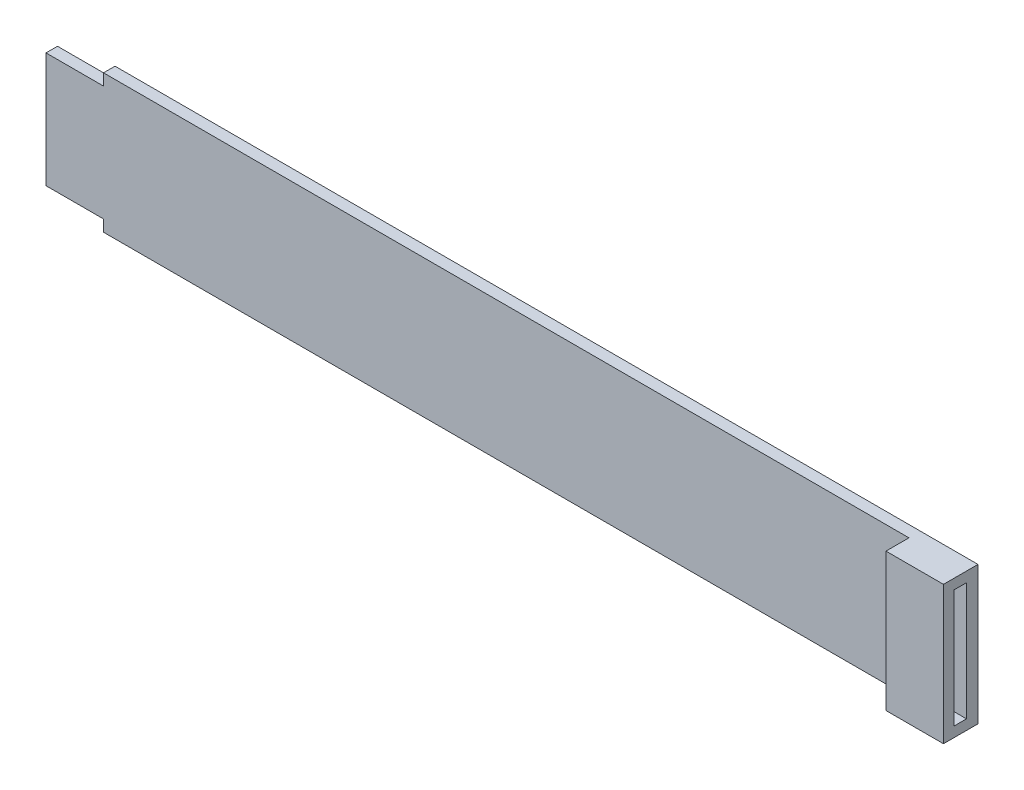
ISO-10303-21;
HEADER;
FILE_DESCRIPTION(('STEP AP214'),'2;1');
FILE_NAME('part.step','',(''),(''),'','','');
FILE_SCHEMA(('AUTOMOTIVE_DESIGN { 1 0 10303 214 1 1 1 1 }'));
ENDSEC;
DATA;
#1=APPLICATION_CONTEXT('core data for automotive mechanical design processes');
#2=APPLICATION_PROTOCOL_DEFINITION('international standard','automotive_design',2000,#1);
#3=PRODUCT_CONTEXT('',#1,'mechanical');
#4=PRODUCT('Part','Part','',(#3));
#5=PRODUCT_RELATED_PRODUCT_CATEGORY('part','',(#4));
#6=PRODUCT_DEFINITION_FORMATION('','',#4);
#7=PRODUCT_DEFINITION_CONTEXT('part definition',#1,'design');
#8=PRODUCT_DEFINITION('design','',#6,#7);
#9=PRODUCT_DEFINITION_SHAPE('','',#8);
#10=(LENGTH_UNIT() NAMED_UNIT(*) SI_UNIT(.MILLI.,.METRE.));
#11=(NAMED_UNIT(*) PLANE_ANGLE_UNIT() SI_UNIT($,.RADIAN.));
#12=(NAMED_UNIT(*) SI_UNIT($,.STERADIAN.) SOLID_ANGLE_UNIT());
#13=UNCERTAINTY_MEASURE_WITH_UNIT(LENGTH_MEASURE(1.E-05),#10,'distance_accuracy_value','');
#14=(GEOMETRIC_REPRESENTATION_CONTEXT(3) GLOBAL_UNCERTAINTY_ASSIGNED_CONTEXT((#13)) GLOBAL_UNIT_ASSIGNED_CONTEXT((#10,
#11,#12)) REPRESENTATION_CONTEXT('',''));
#15=CARTESIAN_POINT('',(0.,0.,0.));
#16=DIRECTION('',(0.,0.,1.));
#17=DIRECTION('',(1.,0.,0.));
#18=AXIS2_PLACEMENT_3D('',#15,#16,#17);
#19=CARTESIAN_POINT('',(0.,0.,2.));
#20=DIRECTION('',(0.,0.,-1.));
#21=DIRECTION('',(-1.,0.,0.));
#22=AXIS2_PLACEMENT_3D('',#19,#20,#21);
#23=PLANE('',#22);
#24=DIRECTION('',(0.,1.,0.));
#25=VECTOR('',#24,1.);
#26=CARTESIAN_POINT('',(151.483458752348,3.29589632829374,2.));
#27=LINE('',#26,#25);
#28=CARTESIAN_POINT('',(151.483458752348,-18.9541036717063,2.));
#29=VERTEX_POINT('',#28);
#30=CARTESIAN_POINT('',(151.483458752348,1.54589632829374,2.));
#31=VERTEX_POINT('',#30);
#32=EDGE_CURVE('E199',#29,#31,#27,.T.);
#33=ORIENTED_EDGE('',*,*,#32,.T.);
#34=DIRECTION('',(1.,0.,0.));
#35=VECTOR('',#34,1.);
#36=CARTESIAN_POINT('',(141.483458752348,1.54589632829374,2.));
#37=LINE('',#36,#35);
#38=CARTESIAN_POINT('',(141.483458752348,1.54589632829374,2.));
#39=VERTEX_POINT('',#38);
#40=EDGE_CURVE('E48',#39,#31,#37,.T.);
#41=ORIENTED_EDGE('',*,*,#40,.F.);
#42=DIRECTION('',(0.,-1.,0.));
#43=VECTOR('',#42,1.);
#44=CARTESIAN_POINT('',(141.483458752348,0.,2.));
#45=LINE('',#44,#43);
#46=CARTESIAN_POINT('',(141.483458752348,3.29589632829374,2.));
#47=VERTEX_POINT('',#46);
#48=EDGE_CURVE('E163',#47,#39,#45,.T.);
#49=ORIENTED_EDGE('',*,*,#48,.F.);
#50=DIRECTION('',(-1.,0.,0.));
#51=VECTOR('',#50,1.);
#52=CARTESIAN_POINT('',(1.48345875234823,3.29589632829374,2.));
#53=LINE('',#52,#51);
#54=CARTESIAN_POINT('',(1.48345875234823,3.29589632829374,2.));
#55=VERTEX_POINT('',#54);
#56=EDGE_CURVE('E201',#47,#55,#53,.T.);
#57=ORIENTED_EDGE('',*,*,#56,.T.);
#58=DIRECTION('',(0.,-1.,0.));
#59=VECTOR('',#58,1.);
#60=CARTESIAN_POINT('',(1.48345875234823,1.29589632829374,2.));
#61=LINE('',#60,#59);
#62=CARTESIAN_POINT('',(1.48345875234823,1.29589632829374,2.));
#63=VERTEX_POINT('',#62);
#64=EDGE_CURVE('E203',#55,#63,#61,.T.);
#65=ORIENTED_EDGE('',*,*,#64,.T.);
#66=DIRECTION('',(-1.,0.,0.));
#67=VECTOR('',#66,1.);
#68=CARTESIAN_POINT('',(-8.51654124765177,1.29589632829374,2.));
#69=LINE('',#68,#67);
#70=CARTESIAN_POINT('',(-8.51654124765177,1.29589632829374,2.));
#71=VERTEX_POINT('',#70);
#72=EDGE_CURVE('E205',#63,#71,#69,.T.);
#73=ORIENTED_EDGE('',*,*,#72,.T.);
#74=DIRECTION('',(0.,-1.,0.));
#75=VECTOR('',#74,1.);
#76=CARTESIAN_POINT('',(-8.51654124765177,1.29589632829374,2.));
#77=LINE('',#76,#75);
#78=CARTESIAN_POINT('',(-8.51654124765177,-18.7041036717063,2.));
#79=VERTEX_POINT('',#78);
#80=EDGE_CURVE('E189',#71,#79,#77,.T.);
#81=ORIENTED_EDGE('',*,*,#80,.T.);
#82=DIRECTION('',(1.,0.,0.));
#83=VECTOR('',#82,1.);
#84=CARTESIAN_POINT('',(1.48345875234823,-18.7041036717063,2.));
#85=LINE('',#84,#83);
#86=CARTESIAN_POINT('',(1.48345875234823,-18.7041036717063,2.));
#87=VERTEX_POINT('',#86);
#88=EDGE_CURVE('E192',#79,#87,#85,.T.);
#89=ORIENTED_EDGE('',*,*,#88,.T.);
#90=DIRECTION('',(0.,-1.,0.));
#91=VECTOR('',#90,1.);
#92=CARTESIAN_POINT('',(1.48345875234823,-20.7041036717063,2.));
#93=LINE('',#92,#91);
#94=CARTESIAN_POINT('',(1.48345875234823,-20.7041036717063,2.));
#95=VERTEX_POINT('',#94);
#96=EDGE_CURVE('E195',#87,#95,#93,.T.);
#97=ORIENTED_EDGE('',*,*,#96,.T.);
#98=DIRECTION('',(1.,0.,0.));
#99=VECTOR('',#98,1.);
#100=CARTESIAN_POINT('',(151.483458752348,-20.7041036717063,2.));
#101=LINE('',#100,#99);
#102=CARTESIAN_POINT('',(141.483458752348,-20.7041036717063,2.));
#103=VERTEX_POINT('',#102);
#104=EDGE_CURVE('E197',#95,#103,#101,.T.);
#105=ORIENTED_EDGE('',*,*,#104,.T.);
#106=CARTESIAN_POINT('',(141.483458752348,-18.9541036717063,2.));
#107=VERTEX_POINT('',#106);
#108=EDGE_CURVE('E55',#107,#103,#45,.T.);
#109=ORIENTED_EDGE('',*,*,#108,.F.);
#110=DIRECTION('',(1.,0.,0.));
#111=VECTOR('',#110,1.);
#112=CARTESIAN_POINT('',(141.483458752348,-18.9541036717063,2.));
#113=LINE('',#112,#111);
#114=EDGE_CURVE('E155',#107,#29,#113,.T.);
#115=ORIENTED_EDGE('',*,*,#114,.T.);
#116=EDGE_LOOP('',(#33,#41,#49,#57,#65,#73,#81,#89,#97,#105,#109,#115));
#117=FACE_BOUND('',#116,.T.);
#118=ADVANCED_FACE('F33',(#117),#23,.F.);
#119=CARTESIAN_POINT('',(-8.51654124765177,1.29589632829374,2.));
#120=DIRECTION('',(1.,0.,0.));
#121=DIRECTION('',(0.,1.,0.));
#122=AXIS2_PLACEMENT_3D('',#119,#120,#121);
#123=PLANE('',#122);
#124=DIRECTION('',(0.,-1.,0.));
#125=VECTOR('',#124,1.);
#126=CARTESIAN_POINT('',(-8.51654124765177,1.29589632829374,0.));
#127=LINE('',#126,#125);
#128=CARTESIAN_POINT('',(-8.51654124765177,1.29589632829374,0.));
#129=VERTEX_POINT('',#128);
#130=CARTESIAN_POINT('',(-8.51654124765177,-18.7041036717063,0.));
#131=VERTEX_POINT('',#130);
#132=EDGE_CURVE('E180',#129,#131,#127,.T.);
#133=ORIENTED_EDGE('',*,*,#132,.T.);
#134=DIRECTION('',(0.,0.,-1.));
#135=VECTOR('',#134,1.);
#136=CARTESIAN_POINT('',(-8.51654124765177,-18.7041036717063,2.));
#137=LINE('',#136,#135);
#138=EDGE_CURVE('E11',#79,#131,#137,.T.);
#139=ORIENTED_EDGE('',*,*,#138,.F.);
#140=ORIENTED_EDGE('',*,*,#80,.F.);
#141=DIRECTION('',(0.,0.,-1.));
#142=VECTOR('',#141,1.);
#143=CARTESIAN_POINT('',(-8.51654124765177,1.29589632829374,2.));
#144=LINE('',#143,#142);
#145=EDGE_CURVE('E207',#71,#129,#144,.T.);
#146=ORIENTED_EDGE('',*,*,#145,.T.);
#147=EDGE_LOOP('',(#133,#139,#140,#146));
#148=FACE_BOUND('',#147,.T.);
#149=ADVANCED_FACE('F35',(#148),#123,.F.);
#150=CARTESIAN_POINT('',(1.48345875234823,-18.7041036717063,2.));
#151=DIRECTION('',(0.,1.,0.));
#152=DIRECTION('',(0.,0.,1.));
#153=AXIS2_PLACEMENT_3D('',#150,#151,#152);
#154=PLANE('',#153);
#155=DIRECTION('',(1.,0.,0.));
#156=VECTOR('',#155,1.);
#157=CARTESIAN_POINT('',(1.48345875234823,-18.7041036717063,0.));
#158=LINE('',#157,#156);
#159=CARTESIAN_POINT('',(1.48345875234823,-18.7041036717063,0.));
#160=VERTEX_POINT('',#159);
#161=EDGE_CURVE('E210',#131,#160,#158,.T.);
#162=ORIENTED_EDGE('',*,*,#161,.T.);
#163=DIRECTION('',(0.,0.,-1.));
#164=VECTOR('',#163,1.);
#165=CARTESIAN_POINT('',(1.48345875234823,-18.7041036717063,2.));
#166=LINE('',#165,#164);
#167=EDGE_CURVE('E41',#87,#160,#166,.T.);
#168=ORIENTED_EDGE('',*,*,#167,.F.);
#169=ORIENTED_EDGE('',*,*,#88,.F.);
#170=ORIENTED_EDGE('',*,*,#138,.T.);
#171=EDGE_LOOP('',(#162,#168,#169,#170));
#172=FACE_BOUND('',#171,.T.);
#173=ADVANCED_FACE('F288',(#172),#154,.F.);
#174=CARTESIAN_POINT('',(1.48345875234823,-20.7041036717063,2.));
#175=DIRECTION('',(1.,0.,0.));
#176=DIRECTION('',(0.,0.,-1.));
#177=AXIS2_PLACEMENT_3D('',#174,#175,#176);
#178=PLANE('',#177);
#179=DIRECTION('',(0.,-1.,0.));
#180=VECTOR('',#179,1.);
#181=CARTESIAN_POINT('',(1.48345875234823,-20.7041036717063,0.));
#182=LINE('',#181,#180);
#183=CARTESIAN_POINT('',(1.48345875234823,-20.7041036717063,0.));
#184=VERTEX_POINT('',#183);
#185=EDGE_CURVE('E212',#160,#184,#182,.T.);
#186=ORIENTED_EDGE('',*,*,#185,.T.);
#187=DIRECTION('',(0.,0.,-1.));
#188=VECTOR('',#187,1.);
#189=CARTESIAN_POINT('',(1.48345875234823,-20.7041036717063,2.));
#190=LINE('',#189,#188);
#191=EDGE_CURVE('E237',#95,#184,#190,.T.);
#192=ORIENTED_EDGE('',*,*,#191,.F.);
#193=ORIENTED_EDGE('',*,*,#96,.F.);
#194=ORIENTED_EDGE('',*,*,#167,.T.);
#195=EDGE_LOOP('',(#186,#192,#193,#194));
#196=FACE_BOUND('',#195,.T.);
#197=ADVANCED_FACE('F244',(#196),#178,.F.);
#198=CARTESIAN_POINT('',(151.483458752348,-20.7041036717063,2.));
#199=DIRECTION('',(0.,1.,0.));
#200=DIRECTION('',(0.,0.,1.));
#201=AXIS2_PLACEMENT_3D('',#198,#199,#200);
#202=PLANE('',#201);
#203=DIRECTION('',(1.,0.,0.));
#204=VECTOR('',#203,1.);
#205=CARTESIAN_POINT('',(151.483458752348,-20.7041036717063,0.));
#206=LINE('',#205,#204);
#207=CARTESIAN_POINT('',(151.483458752348,-20.7041036717063,0.));
#208=VERTEX_POINT('',#207);
#209=EDGE_CURVE('E214',#184,#208,#206,.T.);
#210=ORIENTED_EDGE('',*,*,#209,.T.);
#211=DIRECTION('',(0.,0.,-1.));
#212=VECTOR('',#211,1.);
#213=CARTESIAN_POINT('',(151.483458752348,-20.7041036717063,2.));
#214=LINE('',#213,#212);
#215=CARTESIAN_POINT('',(151.483458752348,-20.7041036717063,6.));
#216=VERTEX_POINT('',#215);
#217=EDGE_CURVE('E234',#216,#208,#214,.T.);
#218=ORIENTED_EDGE('',*,*,#217,.F.);
#219=DIRECTION('',(1.,0.,0.));
#220=VECTOR('',#219,1.);
#221=CARTESIAN_POINT('',(141.483458752348,-20.7041036717063,6.));
#222=LINE('',#221,#220);
#223=CARTESIAN_POINT('',(141.483458752348,-20.7041036717063,6.));
#224=VERTEX_POINT('',#223);
#225=EDGE_CURVE('E181',#224,#216,#222,.T.);
#226=ORIENTED_EDGE('',*,*,#225,.F.);
#227=DIRECTION('',(0.,0.,-1.));
#228=VECTOR('',#227,1.);
#229=CARTESIAN_POINT('',(141.483458752348,-20.7041036717063,0.));
#230=LINE('',#229,#228);
#231=EDGE_CURVE('E171',#224,#103,#230,.T.);
#232=ORIENTED_EDGE('',*,*,#231,.T.);
#233=ORIENTED_EDGE('',*,*,#104,.F.);
#234=ORIENTED_EDGE('',*,*,#191,.T.);
#235=EDGE_LOOP('',(#210,#218,#226,#232,#233,#234));
#236=FACE_BOUND('',#235,.T.);
#237=ADVANCED_FACE('F254',(#236),#202,.F.);
#238=CARTESIAN_POINT('',(151.483458752348,3.29589632829374,2.));
#239=DIRECTION('',(-1.,0.,0.));
#240=DIRECTION('',(0.,0.,1.));
#241=AXIS2_PLACEMENT_3D('',#238,#239,#240);
#242=PLANE('',#241);
#243=DIRECTION('',(0.,0.,-1.));
#244=VECTOR('',#243,1.);
#245=CARTESIAN_POINT('',(151.483458752348,1.54589632829374,0.));
#246=LINE('',#245,#244);
#247=CARTESIAN_POINT('',(151.483458752348,1.54589632829374,4.2));
#248=VERTEX_POINT('',#247);
#249=EDGE_CURVE('E159',#248,#31,#246,.T.);
#250=ORIENTED_EDGE('',*,*,#249,.T.);
#251=ORIENTED_EDGE('',*,*,#32,.F.);
#252=DIRECTION('',(0.,0.,-1.));
#253=VECTOR('',#252,1.);
#254=CARTESIAN_POINT('',(151.483458752348,-18.9541036717063,0.));
#255=LINE('',#254,#253);
#256=CARTESIAN_POINT('',(151.483458752348,-18.9541036717063,4.2));
#257=VERTEX_POINT('',#256);
#258=EDGE_CURVE('E174',#257,#29,#255,.T.);
#259=ORIENTED_EDGE('',*,*,#258,.F.);
#260=DIRECTION('',(0.,-1.,0.));
#261=VECTOR('',#260,1.);
#262=CARTESIAN_POINT('',(151.483458752348,0.,4.2));
#263=LINE('',#262,#261);
#264=EDGE_CURVE('E148',#248,#257,#263,.T.);
#265=ORIENTED_EDGE('',*,*,#264,.F.);
#266=EDGE_LOOP('',(#250,#251,#259,#265));
#267=FACE_BOUND('',#266,.T.);
#268=DIRECTION('',(0.,1.,0.));
#269=VECTOR('',#268,1.);
#270=CARTESIAN_POINT('',(151.483458752348,3.29589632829374,0.));
#271=LINE('',#270,#269);
#272=CARTESIAN_POINT('',(151.483458752348,3.29589632829374,0.));
#273=VERTEX_POINT('',#272);
#274=EDGE_CURVE('E216',#208,#273,#271,.T.);
#275=ORIENTED_EDGE('',*,*,#274,.T.);
#276=DIRECTION('',(0.,0.,-1.));
#277=VECTOR('',#276,1.);
#278=CARTESIAN_POINT('',(151.483458752348,3.29589632829374,2.));
#279=LINE('',#278,#277);
#280=CARTESIAN_POINT('',(151.483458752348,3.29589632829374,6.));
#281=VERTEX_POINT('',#280);
#282=EDGE_CURVE('E231',#281,#273,#279,.T.);
#283=ORIENTED_EDGE('',*,*,#282,.F.);
#284=DIRECTION('',(0.,-1.,0.));
#285=VECTOR('',#284,1.);
#286=CARTESIAN_POINT('',(151.483458752348,0.,6.));
#287=LINE('',#286,#285);
#288=EDGE_CURVE('E156',#281,#216,#287,.T.);
#289=ORIENTED_EDGE('',*,*,#288,.T.);
#290=ORIENTED_EDGE('',*,*,#217,.T.);
#291=EDGE_LOOP('',(#275,#283,#289,#290));
#292=FACE_BOUND('',#291,.T.);
#293=ADVANCED_FACE('F257',(#267,#292),#242,.F.);
#294=CARTESIAN_POINT('',(1.48345875234823,3.29589632829374,2.));
#295=DIRECTION('',(0.,-1.,0.));
#296=DIRECTION('',(0.,0.,-1.));
#297=AXIS2_PLACEMENT_3D('',#294,#295,#296);
#298=PLANE('',#297);
#299=DIRECTION('',(-1.,0.,0.));
#300=VECTOR('',#299,1.);
#301=CARTESIAN_POINT('',(1.48345875234823,3.29589632829374,0.));
#302=LINE('',#301,#300);
#303=CARTESIAN_POINT('',(1.48345875234823,3.29589632829374,0.));
#304=VERTEX_POINT('',#303);
#305=EDGE_CURVE('E218',#273,#304,#302,.T.);
#306=ORIENTED_EDGE('',*,*,#305,.T.);
#307=DIRECTION('',(0.,0.,-1.));
#308=VECTOR('',#307,1.);
#309=CARTESIAN_POINT('',(1.48345875234823,3.29589632829374,2.));
#310=LINE('',#309,#308);
#311=EDGE_CURVE('E228',#55,#304,#310,.T.);
#312=ORIENTED_EDGE('',*,*,#311,.F.);
#313=ORIENTED_EDGE('',*,*,#56,.F.);
#314=DIRECTION('',(0.,0.,1.));
#315=VECTOR('',#314,1.);
#316=CARTESIAN_POINT('',(141.483458752348,3.29589632829374,0.));
#317=LINE('',#316,#315);
#318=CARTESIAN_POINT('',(141.483458752348,3.29589632829374,6.));
#319=VERTEX_POINT('',#318);
#320=EDGE_CURVE('E165',#47,#319,#317,.T.);
#321=ORIENTED_EDGE('',*,*,#320,.T.);
#322=DIRECTION('',(1.,0.,0.));
#323=VECTOR('',#322,1.);
#324=CARTESIAN_POINT('',(141.483458752348,3.29589632829374,6.));
#325=LINE('',#324,#323);
#326=EDGE_CURVE('E184',#319,#281,#325,.T.);
#327=ORIENTED_EDGE('',*,*,#326,.T.);
#328=ORIENTED_EDGE('',*,*,#282,.T.);
#329=EDGE_LOOP('',(#306,#312,#313,#321,#327,#328));
#330=FACE_BOUND('',#329,.T.);
#331=ADVANCED_FACE('F266',(#330),#298,.F.);
#332=CARTESIAN_POINT('',(1.48345875234823,1.29589632829374,2.));
#333=DIRECTION('',(1.,0.,0.));
#334=DIRECTION('',(0.,0.,-1.));
#335=AXIS2_PLACEMENT_3D('',#332,#333,#334);
#336=PLANE('',#335);
#337=DIRECTION('',(0.,-1.,0.));
#338=VECTOR('',#337,1.);
#339=CARTESIAN_POINT('',(1.48345875234823,1.29589632829374,0.));
#340=LINE('',#339,#338);
#341=CARTESIAN_POINT('',(1.48345875234823,1.29589632829374,0.));
#342=VERTEX_POINT('',#341);
#343=EDGE_CURVE('E220',#304,#342,#340,.T.);
#344=ORIENTED_EDGE('',*,*,#343,.T.);
#345=DIRECTION('',(0.,0.,-1.));
#346=VECTOR('',#345,1.);
#347=CARTESIAN_POINT('',(1.48345875234823,1.29589632829374,2.));
#348=LINE('',#347,#346);
#349=EDGE_CURVE('E225',#63,#342,#348,.T.);
#350=ORIENTED_EDGE('',*,*,#349,.F.);
#351=ORIENTED_EDGE('',*,*,#64,.F.);
#352=ORIENTED_EDGE('',*,*,#311,.T.);
#353=EDGE_LOOP('',(#344,#350,#351,#352));
#354=FACE_BOUND('',#353,.T.);
#355=ADVANCED_FACE('F280',(#354),#336,.F.);
#356=CARTESIAN_POINT('',(-8.51654124765177,1.29589632829374,2.));
#357=DIRECTION('',(0.,-1.,0.));
#358=DIRECTION('',(0.,0.,-1.));
#359=AXIS2_PLACEMENT_3D('',#356,#357,#358);
#360=PLANE('',#359);
#361=DIRECTION('',(-1.,0.,0.));
#362=VECTOR('',#361,1.);
#363=CARTESIAN_POINT('',(-8.51654124765177,1.29589632829374,0.));
#364=LINE('',#363,#362);
#365=EDGE_CURVE('E193',#342,#129,#364,.T.);
#366=ORIENTED_EDGE('',*,*,#365,.T.);
#367=ORIENTED_EDGE('',*,*,#145,.F.);
#368=ORIENTED_EDGE('',*,*,#72,.F.);
#369=ORIENTED_EDGE('',*,*,#349,.T.);
#370=EDGE_LOOP('',(#366,#367,#368,#369));
#371=FACE_BOUND('',#370,.T.);
#372=ADVANCED_FACE('F295',(#371),#360,.F.);
#373=CARTESIAN_POINT('',(0.,0.,0.));
#374=DIRECTION('',(0.,0.,-1.));
#375=DIRECTION('',(-1.,0.,0.));
#376=AXIS2_PLACEMENT_3D('',#373,#374,#375);
#377=PLANE('',#376);
#378=ORIENTED_EDGE('',*,*,#132,.F.);
#379=ORIENTED_EDGE('',*,*,#365,.F.);
#380=ORIENTED_EDGE('',*,*,#343,.F.);
#381=ORIENTED_EDGE('',*,*,#305,.F.);
#382=ORIENTED_EDGE('',*,*,#274,.F.);
#383=ORIENTED_EDGE('',*,*,#209,.F.);
#384=ORIENTED_EDGE('',*,*,#185,.F.);
#385=ORIENTED_EDGE('',*,*,#161,.F.);
#386=EDGE_LOOP('',(#378,#379,#380,#381,#382,#383,#384,#385));
#387=FACE_BOUND('',#386,.T.);
#388=ADVANCED_FACE('F250',(#387),#377,.T.);
#389=CARTESIAN_POINT('',(141.483458752348,-18.9541036717063,0.));
#390=DIRECTION('',(0.,-1.,0.));
#391=DIRECTION('',(0.,0.,-1.));
#392=AXIS2_PLACEMENT_3D('',#389,#390,#391);
#393=PLANE('',#392);
#394=ORIENTED_EDGE('',*,*,#258,.T.);
#395=ORIENTED_EDGE('',*,*,#114,.F.);
#396=DIRECTION('',(0.,0.,-1.));
#397=VECTOR('',#396,1.);
#398=CARTESIAN_POINT('',(141.483458752348,-18.9541036717063,0.));
#399=LINE('',#398,#397);
#400=CARTESIAN_POINT('',(141.483458752348,-18.9541036717063,4.2));
#401=VERTEX_POINT('',#400);
#402=EDGE_CURVE('E138',#401,#107,#399,.T.);
#403=ORIENTED_EDGE('',*,*,#402,.F.);
#404=DIRECTION('',(1.,0.,0.));
#405=VECTOR('',#404,1.);
#406=CARTESIAN_POINT('',(141.483458752348,-18.9541036717063,4.2));
#407=LINE('',#406,#405);
#408=EDGE_CURVE('E145',#401,#257,#407,.T.);
#409=ORIENTED_EDGE('',*,*,#408,.T.);
#410=EDGE_LOOP('',(#394,#395,#403,#409));
#411=FACE_BOUND('',#410,.T.);
#412=ADVANCED_FACE('F154',(#411),#393,.F.);
#413=CARTESIAN_POINT('',(141.483458752348,0.,6.));
#414=DIRECTION('',(0.,0.,1.));
#415=DIRECTION('',(1.,0.,0.));
#416=AXIS2_PLACEMENT_3D('',#413,#414,#415);
#417=PLANE('',#416);
#418=ORIENTED_EDGE('',*,*,#288,.F.);
#419=ORIENTED_EDGE('',*,*,#326,.F.);
#420=DIRECTION('',(0.,-1.,0.));
#421=VECTOR('',#420,1.);
#422=CARTESIAN_POINT('',(141.483458752348,0.,6.));
#423=LINE('',#422,#421);
#424=EDGE_CURVE('E168',#319,#224,#423,.T.);
#425=ORIENTED_EDGE('',*,*,#424,.T.);
#426=ORIENTED_EDGE('',*,*,#225,.T.);
#427=EDGE_LOOP('',(#418,#419,#425,#426));
#428=FACE_BOUND('',#427,.T.);
#429=ADVANCED_FACE('F260',(#428),#417,.T.);
#430=CARTESIAN_POINT('',(141.483458752348,1.54589632829374,0.));
#431=DIRECTION('',(0.,-1.,0.));
#432=DIRECTION('',(0.,0.,-1.));
#433=AXIS2_PLACEMENT_3D('',#430,#431,#432);
#434=PLANE('',#433);
#435=ORIENTED_EDGE('',*,*,#249,.F.);
#436=DIRECTION('',(1.,0.,0.));
#437=VECTOR('',#436,1.);
#438=CARTESIAN_POINT('',(141.483458752348,1.54589632829374,4.2));
#439=LINE('',#438,#437);
#440=CARTESIAN_POINT('',(141.483458752348,1.54589632829374,4.2));
#441=VERTEX_POINT('',#440);
#442=EDGE_CURVE('E152',#441,#248,#439,.T.);
#443=ORIENTED_EDGE('',*,*,#442,.F.);
#444=DIRECTION('',(0.,0.,-1.));
#445=VECTOR('',#444,1.);
#446=CARTESIAN_POINT('',(141.483458752348,1.54589632829374,0.));
#447=LINE('',#446,#445);
#448=EDGE_CURVE('E141',#441,#39,#447,.T.);
#449=ORIENTED_EDGE('',*,*,#448,.T.);
#450=ORIENTED_EDGE('',*,*,#40,.T.);
#451=EDGE_LOOP('',(#435,#443,#449,#450));
#452=FACE_BOUND('',#451,.T.);
#453=ADVANCED_FACE('F272',(#452),#434,.T.);
#454=CARTESIAN_POINT('',(141.483458752348,0.,4.2));
#455=DIRECTION('',(0.,0.,1.));
#456=DIRECTION('',(0.,-1.,0.));
#457=AXIS2_PLACEMENT_3D('',#454,#455,#456);
#458=PLANE('',#457);
#459=ORIENTED_EDGE('',*,*,#264,.T.);
#460=ORIENTED_EDGE('',*,*,#408,.F.);
#461=DIRECTION('',(0.,-1.,0.));
#462=VECTOR('',#461,1.);
#463=CARTESIAN_POINT('',(141.483458752348,0.,4.2));
#464=LINE('',#463,#462);
#465=EDGE_CURVE('E134',#441,#401,#464,.T.);
#466=ORIENTED_EDGE('',*,*,#465,.F.);
#467=ORIENTED_EDGE('',*,*,#442,.T.);
#468=EDGE_LOOP('',(#459,#460,#466,#467));
#469=FACE_BOUND('',#468,.T.);
#470=ADVANCED_FACE('F146',(#469),#458,.F.);
#471=CARTESIAN_POINT('',(141.483458752348,0.,0.));
#472=DIRECTION('',(1.,0.,0.));
#473=DIRECTION('',(0.,0.,-1.));
#474=AXIS2_PLACEMENT_3D('',#471,#472,#473);
#475=PLANE('',#474);
#476=ORIENTED_EDGE('',*,*,#402,.T.);
#477=ORIENTED_EDGE('',*,*,#108,.T.);
#478=ORIENTED_EDGE('',*,*,#231,.F.);
#479=ORIENTED_EDGE('',*,*,#424,.F.);
#480=ORIENTED_EDGE('',*,*,#320,.F.);
#481=ORIENTED_EDGE('',*,*,#48,.T.);
#482=ORIENTED_EDGE('',*,*,#448,.F.);
#483=ORIENTED_EDGE('',*,*,#465,.T.);
#484=EDGE_LOOP('',(#476,#477,#478,#479,#480,#481,#482,#483));
#485=FACE_BOUND('',#484,.T.);
#486=ADVANCED_FACE('F136',(#485),#475,.F.);
#487=CLOSED_SHELL('',(#118,#149,#173,#197,#237,#293,#331,#355,#372,#388,#412,#429,#453,#470,#486));
#488=MANIFOLD_SOLID_BREP('B2',#487);
#489=ADVANCED_BREP_SHAPE_REPRESENTATION('',(#18,#488),#14);
#490=SHAPE_DEFINITION_REPRESENTATION(#9,#489);
ENDSEC;
END-ISO-10303-21;
